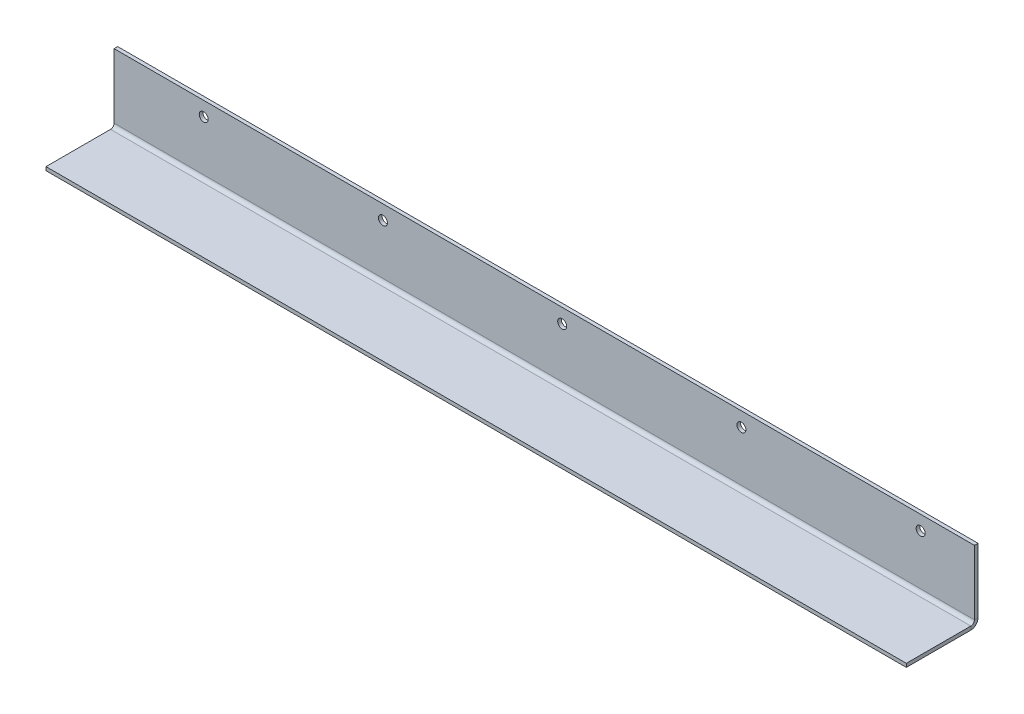
ISO-10303-21;
HEADER;
FILE_DESCRIPTION(('STEP AP214'),'2;1');
FILE_NAME('part.step','',(''),(''),'','','');
FILE_SCHEMA(('AUTOMOTIVE_DESIGN { 1 0 10303 214 1 1 1 1 }'));
ENDSEC;
DATA;
#1=APPLICATION_CONTEXT('core data for automotive mechanical design processes');
#2=APPLICATION_PROTOCOL_DEFINITION('international standard','automotive_design',2000,#1);
#3=PRODUCT_CONTEXT('',#1,'mechanical');
#4=PRODUCT('Part','Part','',(#3));
#5=PRODUCT_RELATED_PRODUCT_CATEGORY('part','',(#4));
#6=PRODUCT_DEFINITION_FORMATION('','',#4);
#7=PRODUCT_DEFINITION_CONTEXT('part definition',#1,'design');
#8=PRODUCT_DEFINITION('design','',#6,#7);
#9=PRODUCT_DEFINITION_SHAPE('','',#8);
#10=(LENGTH_UNIT() NAMED_UNIT(*) SI_UNIT(.MILLI.,.METRE.));
#11=(NAMED_UNIT(*) PLANE_ANGLE_UNIT() SI_UNIT($,.RADIAN.));
#12=(NAMED_UNIT(*) SI_UNIT($,.STERADIAN.) SOLID_ANGLE_UNIT());
#13=UNCERTAINTY_MEASURE_WITH_UNIT(LENGTH_MEASURE(1.E-05),#10,'distance_accuracy_value','');
#14=(GEOMETRIC_REPRESENTATION_CONTEXT(3) GLOBAL_UNCERTAINTY_ASSIGNED_CONTEXT((#13)) GLOBAL_UNIT_ASSIGNED_CONTEXT((#10,
#11,#12)) REPRESENTATION_CONTEXT('',''));
#15=CARTESIAN_POINT('',(0.,0.,0.));
#16=DIRECTION('',(0.,0.,1.));
#17=DIRECTION('',(1.,0.,0.));
#18=AXIS2_PLACEMENT_3D('',#15,#16,#17);
#19=CARTESIAN_POINT('',(0.,-2.,0.));
#20=DIRECTION('',(-1.,0.,0.));
#21=DIRECTION('',(0.,0.,1.));
#22=AXIS2_PLACEMENT_3D('',#19,#20,#21);
#23=PLANE('',#22);
#24=DIRECTION('',(0.,0.,1.));
#25=VECTOR('',#24,1.);
#26=CARTESIAN_POINT('',(0.,0.,0.));
#27=LINE('',#26,#25);
#28=CARTESIAN_POINT('',(0.,0.,-36.));
#29=VERTEX_POINT('',#28);
#30=CARTESIAN_POINT('',(0.,0.,0.));
#31=VERTEX_POINT('',#30);
#32=EDGE_CURVE('E112',#29,#31,#27,.T.);
#33=ORIENTED_EDGE('',*,*,#32,.F.);
#34=DIRECTION('',(0.,-1.,0.));
#35=VECTOR('',#34,1.);
#36=CARTESIAN_POINT('',(0.,0.,-36.));
#37=LINE('',#36,#35);
#38=CARTESIAN_POINT('',(0.,-2.00000000000001,-36.));
#39=VERTEX_POINT('',#38);
#40=EDGE_CURVE('E156',#29,#39,#37,.T.);
#41=ORIENTED_EDGE('',*,*,#40,.T.);
#42=DIRECTION('',(0.,0.,1.));
#43=VECTOR('',#42,1.);
#44=CARTESIAN_POINT('',(0.,-2.,0.));
#45=LINE('',#44,#43);
#46=CARTESIAN_POINT('',(0.,-2.,0.));
#47=VERTEX_POINT('',#46);
#48=EDGE_CURVE('E108',#39,#47,#45,.T.);
#49=ORIENTED_EDGE('',*,*,#48,.T.);
#50=DIRECTION('',(0.,1.,0.));
#51=VECTOR('',#50,1.);
#52=CARTESIAN_POINT('',(0.,-2.,0.));
#53=LINE('',#52,#51);
#54=EDGE_CURVE('E66',#47,#31,#53,.T.);
#55=ORIENTED_EDGE('',*,*,#54,.T.);
#56=EDGE_LOOP('',(#33,#41,#49,#55));
#57=FACE_BOUND('',#56,.T.);
#58=ADVANCED_FACE('F58',(#57),#23,.T.);
#59=CARTESIAN_POINT('',(0.,-2.,0.));
#60=DIRECTION('',(0.,-1.,0.));
#61=DIRECTION('',(0.,0.,-1.));
#62=AXIS2_PLACEMENT_3D('',#59,#60,#61);
#63=PLANE('',#62);
#64=ORIENTED_EDGE('',*,*,#48,.F.);
#65=DIRECTION('',(-1.,0.,0.));
#66=VECTOR('',#65,1.);
#67=CARTESIAN_POINT('',(0.,-2.00000000000001,-36.));
#68=LINE('',#67,#66);
#69=CARTESIAN_POINT('',(480.,-2.,-36.));
#70=VERTEX_POINT('',#69);
#71=EDGE_CURVE('E151',#39,#70,#68,.F.);
#72=ORIENTED_EDGE('',*,*,#71,.T.);
#73=DIRECTION('',(0.,0.,-1.));
#74=VECTOR('',#73,1.);
#75=CARTESIAN_POINT('',(480.,-2.,0.));
#76=LINE('',#75,#74);
#77=CARTESIAN_POINT('',(480.,-2.,0.));
#78=VERTEX_POINT('',#77);
#79=EDGE_CURVE('E119',#78,#70,#76,.T.);
#80=ORIENTED_EDGE('',*,*,#79,.F.);
#81=DIRECTION('',(1.,0.,0.));
#82=VECTOR('',#81,1.);
#83=CARTESIAN_POINT('',(0.,-2.,0.));
#84=LINE('',#83,#82);
#85=EDGE_CURVE('E99',#47,#78,#84,.T.);
#86=ORIENTED_EDGE('',*,*,#85,.F.);
#87=EDGE_LOOP('',(#64,#72,#80,#86));
#88=FACE_BOUND('',#87,.T.);
#89=ADVANCED_FACE('F175',(#88),#63,.T.);
#90=CARTESIAN_POINT('',(0.,0.,0.));
#91=DIRECTION('',(0.,-1.,0.));
#92=DIRECTION('',(0.,0.,-1.));
#93=AXIS2_PLACEMENT_3D('',#90,#91,#92);
#94=PLANE('',#93);
#95=DIRECTION('',(-1.,0.,0.));
#96=VECTOR('',#95,1.);
#97=CARTESIAN_POINT('',(0.,0.,-36.));
#98=LINE('',#97,#96);
#99=CARTESIAN_POINT('',(480.,0.,-36.));
#100=VERTEX_POINT('',#99);
#101=EDGE_CURVE('E162',#29,#100,#98,.F.);
#102=ORIENTED_EDGE('',*,*,#101,.F.);
#103=ORIENTED_EDGE('',*,*,#32,.T.);
#104=DIRECTION('',(1.,0.,0.));
#105=VECTOR('',#104,1.);
#106=CARTESIAN_POINT('',(0.,0.,0.));
#107=LINE('',#106,#105);
#108=CARTESIAN_POINT('',(480.,0.,0.));
#109=VERTEX_POINT('',#108);
#110=EDGE_CURVE('E97',#31,#109,#107,.T.);
#111=ORIENTED_EDGE('',*,*,#110,.T.);
#112=DIRECTION('',(0.,0.,-1.));
#113=VECTOR('',#112,1.);
#114=CARTESIAN_POINT('',(480.,0.,0.));
#115=LINE('',#114,#113);
#116=EDGE_CURVE('E102',#109,#100,#115,.T.);
#117=ORIENTED_EDGE('',*,*,#116,.T.);
#118=EDGE_LOOP('',(#102,#103,#111,#117));
#119=FACE_BOUND('',#118,.T.);
#120=ADVANCED_FACE('F110',(#119),#94,.F.);
#121=CARTESIAN_POINT('',(480.,-2.,0.));
#122=DIRECTION('',(1.,0.,0.));
#123=DIRECTION('',(0.,0.,-1.));
#124=AXIS2_PLACEMENT_3D('',#121,#122,#123);
#125=PLANE('',#124);
#126=DIRECTION('',(0.,-1.,0.));
#127=VECTOR('',#126,1.);
#128=CARTESIAN_POINT('',(480.,0.,-36.));
#129=LINE('',#128,#127);
#130=EDGE_CURVE('E105',#100,#70,#129,.T.);
#131=ORIENTED_EDGE('',*,*,#130,.F.);
#132=ORIENTED_EDGE('',*,*,#116,.F.);
#133=DIRECTION('',(0.,1.,0.));
#134=VECTOR('',#133,1.);
#135=CARTESIAN_POINT('',(480.,-2.,0.));
#136=LINE('',#135,#134);
#137=EDGE_CURVE('E13',#78,#109,#136,.T.);
#138=ORIENTED_EDGE('',*,*,#137,.F.);
#139=ORIENTED_EDGE('',*,*,#79,.T.);
#140=EDGE_LOOP('',(#131,#132,#138,#139));
#141=FACE_BOUND('',#140,.T.);
#142=ADVANCED_FACE('F103',(#141),#125,.T.);
#143=CARTESIAN_POINT('',(0.,-2.,0.));
#144=DIRECTION('',(0.,0.,1.));
#145=DIRECTION('',(1.,0.,0.));
#146=AXIS2_PLACEMENT_3D('',#143,#144,#145);
#147=PLANE('',#146);
#148=ORIENTED_EDGE('',*,*,#110,.F.);
#149=ORIENTED_EDGE('',*,*,#54,.F.);
#150=ORIENTED_EDGE('',*,*,#85,.T.);
#151=ORIENTED_EDGE('',*,*,#137,.T.);
#152=EDGE_LOOP('',(#148,#149,#150,#151));
#153=FACE_BOUND('',#152,.T.);
#154=ADVANCED_FACE('F94',(#153),#147,.T.);
#155=CARTESIAN_POINT('',(480.,1.99999999999999,-36.));
#156=DIRECTION('',(1.,0.,0.));
#157=DIRECTION('',(0.,0.,-1.));
#158=AXIS2_PLACEMENT_3D('',#155,#156,#157);
#159=PLANE('',#158);
#160=DIRECTION('',(0.,0.,1.));
#161=VECTOR('',#160,1.);
#162=CARTESIAN_POINT('',(480.,2.00000000000001,-40.));
#163=LINE('',#162,#161);
#164=CARTESIAN_POINT('',(480.,1.99999999999998,-38.));
#165=VERTEX_POINT('',#164);
#166=CARTESIAN_POINT('',(480.,1.99999999999997,-40.));
#167=VERTEX_POINT('',#166);
#168=EDGE_CURVE('E134',#165,#167,#163,.F.);
#169=ORIENTED_EDGE('',*,*,#168,.F.);
#170=CARTESIAN_POINT('',(480.,1.99999999999999,-36.));
#171=DIRECTION('',(-1.,0.,0.));
#172=DIRECTION('',(0.,0.,1.));
#173=AXIS2_PLACEMENT_3D('',#170,#171,#172);
#174=CIRCLE('',#173,2.);
#175=EDGE_CURVE('E159',#100,#165,#174,.F.);
#176=ORIENTED_EDGE('',*,*,#175,.F.);
#177=ORIENTED_EDGE('',*,*,#130,.T.);
#178=CARTESIAN_POINT('',(480.,1.99999999999999,-36.));
#179=DIRECTION('',(-1.,0.,0.));
#180=DIRECTION('',(0.,0.,1.));
#181=AXIS2_PLACEMENT_3D('',#178,#179,#180);
#182=CIRCLE('',#181,4.);
#183=EDGE_CURVE('E74',#70,#167,#182,.F.);
#184=ORIENTED_EDGE('',*,*,#183,.T.);
#185=EDGE_LOOP('',(#169,#176,#177,#184));
#186=FACE_BOUND('',#185,.T.);
#187=ADVANCED_FACE('F218',(#186),#159,.T.);
#188=CARTESIAN_POINT('',(0.,1.99999999999999,-36.));
#189=DIRECTION('',(1.,0.,0.));
#190=DIRECTION('',(0.,0.,-1.));
#191=AXIS2_PLACEMENT_3D('',#188,#189,#190);
#192=PLANE('',#191);
#193=CARTESIAN_POINT('',(0.,1.99999999999999,-36.));
#194=DIRECTION('',(-1.,0.,0.));
#195=DIRECTION('',(0.,0.,1.));
#196=AXIS2_PLACEMENT_3D('',#193,#194,#195);
#197=CIRCLE('',#196,2.);
#198=CARTESIAN_POINT('',(0.,1.99999999999998,-38.));
#199=VERTEX_POINT('',#198);
#200=EDGE_CURVE('E165',#199,#29,#197,.T.);
#201=ORIENTED_EDGE('',*,*,#200,.F.);
#202=DIRECTION('',(0.,0.,1.));
#203=VECTOR('',#202,1.);
#204=CARTESIAN_POINT('',(0.,2.00000000000001,-38.));
#205=LINE('',#204,#203);
#206=CARTESIAN_POINT('',(0.,2.00000000000002,-40.));
#207=VERTEX_POINT('',#206);
#208=EDGE_CURVE('E147',#199,#207,#205,.F.);
#209=ORIENTED_EDGE('',*,*,#208,.T.);
#210=CARTESIAN_POINT('',(0.,1.99999999999999,-36.));
#211=DIRECTION('',(-1.,0.,0.));
#212=DIRECTION('',(0.,0.,1.));
#213=AXIS2_PLACEMENT_3D('',#210,#211,#212);
#214=CIRCLE('',#213,4.);
#215=EDGE_CURVE('E154',#207,#39,#214,.T.);
#216=ORIENTED_EDGE('',*,*,#215,.T.);
#217=ORIENTED_EDGE('',*,*,#40,.F.);
#218=EDGE_LOOP('',(#201,#209,#216,#217));
#219=FACE_BOUND('',#218,.T.);
#220=ADVANCED_FACE('F184',(#219),#192,.F.);
#221=CARTESIAN_POINT('',(0.,1.99999999999999,-36.));
#222=DIRECTION('',(-1.,0.,0.));
#223=DIRECTION('',(0.,0.,-1.));
#224=AXIS2_PLACEMENT_3D('',#221,#222,#223);
#225=CYLINDRICAL_SURFACE('',#224,4.);
#226=ORIENTED_EDGE('',*,*,#71,.F.);
#227=ORIENTED_EDGE('',*,*,#215,.F.);
#228=DIRECTION('',(-1.,0.,0.));
#229=VECTOR('',#228,1.);
#230=CARTESIAN_POINT('',(480.,2.00000000000001,-40.));
#231=LINE('',#230,#229);
#232=EDGE_CURVE('E214',#207,#167,#231,.F.);
#233=ORIENTED_EDGE('',*,*,#232,.T.);
#234=ORIENTED_EDGE('',*,*,#183,.F.);
#235=EDGE_LOOP('',(#226,#227,#233,#234));
#236=FACE_BOUND('',#235,.T.);
#237=ADVANCED_FACE('F177',(#236),#225,.T.);
#238=CARTESIAN_POINT('',(0.,1.99999999999999,-36.));
#239=DIRECTION('',(-1.,0.,0.));
#240=DIRECTION('',(0.,0.,-1.));
#241=AXIS2_PLACEMENT_3D('',#238,#239,#240);
#242=CYLINDRICAL_SURFACE('',#241,2.);
#243=ORIENTED_EDGE('',*,*,#101,.T.);
#244=ORIENTED_EDGE('',*,*,#175,.T.);
#245=DIRECTION('',(-1.,0.,0.));
#246=VECTOR('',#245,1.);
#247=CARTESIAN_POINT('',(480.,1.99999999999999,-38.));
#248=LINE('',#247,#246);
#249=EDGE_CURVE('E138',#165,#199,#248,.T.);
#250=ORIENTED_EDGE('',*,*,#249,.T.);
#251=ORIENTED_EDGE('',*,*,#200,.T.);
#252=EDGE_LOOP('',(#243,#244,#250,#251));
#253=FACE_BOUND('',#252,.T.);
#254=ADVANCED_FACE('F221',(#253),#242,.F.);
#255=CARTESIAN_POINT('',(480.,0.,-40.));
#256=DIRECTION('',(-1.,0.,0.));
#257=DIRECTION('',(0.,0.,1.));
#258=AXIS2_PLACEMENT_3D('',#255,#256,#257);
#259=PLANE('',#258);
#260=ORIENTED_EDGE('',*,*,#168,.T.);
#261=DIRECTION('',(0.,-1.,0.));
#262=VECTOR('',#261,1.);
#263=CARTESIAN_POINT('',(480.,-1.45760840755831E-13,-40.));
#264=LINE('',#263,#262);
#265=CARTESIAN_POINT('',(480.,38.,-40.0000000000001));
#266=VERTEX_POINT('',#265);
#267=EDGE_CURVE('E236',#266,#167,#264,.T.);
#268=ORIENTED_EDGE('',*,*,#267,.F.);
#269=DIRECTION('',(0.,0.,1.));
#270=VECTOR('',#269,1.);
#271=CARTESIAN_POINT('',(480.,38.,-40.0000000000001));
#272=LINE('',#271,#270);
#273=CARTESIAN_POINT('',(480.,38.,-38.0000000000001));
#274=VERTEX_POINT('',#273);
#275=EDGE_CURVE('E230',#266,#274,#272,.T.);
#276=ORIENTED_EDGE('',*,*,#275,.T.);
#277=DIRECTION('',(0.,1.,0.));
#278=VECTOR('',#277,1.);
#279=CARTESIAN_POINT('',(480.,0.,-38.));
#280=LINE('',#279,#278);
#281=EDGE_CURVE('E216',#274,#165,#280,.F.);
#282=ORIENTED_EDGE('',*,*,#281,.T.);
#283=EDGE_LOOP('',(#260,#268,#276,#282));
#284=FACE_BOUND('',#283,.T.);
#285=ADVANCED_FACE('F229',(#284),#259,.F.);
#286=CARTESIAN_POINT('',(0.,38.,-40.0000000000001));
#287=DIRECTION('',(1.,0.,0.));
#288=DIRECTION('',(0.,0.,-1.));
#289=AXIS2_PLACEMENT_3D('',#286,#287,#288);
#290=PLANE('',#289);
#291=ORIENTED_EDGE('',*,*,#208,.F.);
#292=DIRECTION('',(0.,-1.,0.));
#293=VECTOR('',#292,1.);
#294=CARTESIAN_POINT('',(0.,38.,-38.0000000000001));
#295=LINE('',#294,#293);
#296=CARTESIAN_POINT('',(0.,38.,-38.0000000000001));
#297=VERTEX_POINT('',#296);
#298=EDGE_CURVE('E227',#199,#297,#295,.F.);
#299=ORIENTED_EDGE('',*,*,#298,.T.);
#300=DIRECTION('',(0.,0.,1.));
#301=VECTOR('',#300,1.);
#302=CARTESIAN_POINT('',(0.,38.,-40.0000000000001));
#303=LINE('',#302,#301);
#304=CARTESIAN_POINT('',(0.,38.,-40.0000000000001));
#305=VERTEX_POINT('',#304);
#306=EDGE_CURVE('E168',#305,#297,#303,.T.);
#307=ORIENTED_EDGE('',*,*,#306,.F.);
#308=DIRECTION('',(0.,1.,0.));
#309=VECTOR('',#308,1.);
#310=CARTESIAN_POINT('',(0.,-1.45760840755831E-13,-40.));
#311=LINE('',#310,#309);
#312=EDGE_CURVE('E238',#207,#305,#311,.T.);
#313=ORIENTED_EDGE('',*,*,#312,.F.);
#314=EDGE_LOOP('',(#291,#299,#307,#313));
#315=FACE_BOUND('',#314,.T.);
#316=ADVANCED_FACE('F264',(#315),#290,.F.);
#317=CARTESIAN_POINT('',(0.,-1.45760840755831E-13,-40.));
#318=DIRECTION('',(0.,0.,1.));
#319=DIRECTION('',(0.,-1.,0.));
#320=AXIS2_PLACEMENT_3D('',#317,#318,#319);
#321=PLANE('',#320);
#322=CARTESIAN_POINT('',(450.,29.9999999999999,-40.0000000000001));
#323=DIRECTION('',(0.,0.,-1.));
#324=DIRECTION('',(0.,1.,0.));
#325=AXIS2_PLACEMENT_3D('',#322,#323,#324);
#326=CIRCLE('',#325,2.50000000000002);
#327=CARTESIAN_POINT('',(450.,32.4999999999999,-40.0000000000001));
#328=VERTEX_POINT('',#327);
#329=EDGE_CURVE('E124',#328,#328,#326,.T.);
#330=ORIENTED_EDGE('',*,*,#329,.F.);
#331=EDGE_LOOP('',(#330));
#332=FACE_BOUND('',#331,.T.);
#333=CARTESIAN_POINT('',(350.,29.9999999999999,-40.0000000000001));
#334=DIRECTION('',(0.,0.,-1.));
#335=DIRECTION('',(0.,1.,0.));
#336=AXIS2_PLACEMENT_3D('',#333,#334,#335);
#337=CIRCLE('',#336,2.50000000000002);
#338=CARTESIAN_POINT('',(350.,32.4999999999999,-40.0000000000001));
#339=VERTEX_POINT('',#338);
#340=EDGE_CURVE('E253',#339,#339,#337,.T.);
#341=ORIENTED_EDGE('',*,*,#340,.F.);
#342=EDGE_LOOP('',(#341));
#343=FACE_BOUND('',#342,.T.);
#344=CARTESIAN_POINT('',(250.,29.9999999999999,-40.0000000000001));
#345=DIRECTION('',(0.,0.,-1.));
#346=DIRECTION('',(0.,1.,0.));
#347=AXIS2_PLACEMENT_3D('',#344,#345,#346);
#348=CIRCLE('',#347,2.50000000000002);
#349=CARTESIAN_POINT('',(250.,32.4999999999999,-40.0000000000001));
#350=VERTEX_POINT('',#349);
#351=EDGE_CURVE('E250',#350,#350,#348,.T.);
#352=ORIENTED_EDGE('',*,*,#351,.F.);
#353=EDGE_LOOP('',(#352));
#354=FACE_BOUND('',#353,.T.);
#355=CARTESIAN_POINT('',(150.,29.9999999999999,-40.0000000000001));
#356=DIRECTION('',(0.,0.,-1.));
#357=DIRECTION('',(0.,1.,0.));
#358=AXIS2_PLACEMENT_3D('',#355,#356,#357);
#359=CIRCLE('',#358,2.50000000000002);
#360=CARTESIAN_POINT('',(150.,32.4999999999999,-40.0000000000001));
#361=VERTEX_POINT('',#360);
#362=EDGE_CURVE('E247',#361,#361,#359,.T.);
#363=ORIENTED_EDGE('',*,*,#362,.F.);
#364=EDGE_LOOP('',(#363));
#365=FACE_BOUND('',#364,.T.);
#366=CARTESIAN_POINT('',(50.,29.9999999999999,-40.0000000000001));
#367=DIRECTION('',(0.,0.,-1.));
#368=DIRECTION('',(0.,1.,0.));
#369=AXIS2_PLACEMENT_3D('',#366,#367,#368);
#370=CIRCLE('',#369,2.50000000000002);
#371=CARTESIAN_POINT('',(50.,32.4999999999999,-40.0000000000001));
#372=VERTEX_POINT('',#371);
#373=EDGE_CURVE('E244',#372,#372,#370,.T.);
#374=ORIENTED_EDGE('',*,*,#373,.F.);
#375=EDGE_LOOP('',(#374));
#376=FACE_BOUND('',#375,.T.);
#377=ORIENTED_EDGE('',*,*,#232,.F.);
#378=ORIENTED_EDGE('',*,*,#312,.T.);
#379=DIRECTION('',(1.,0.,0.));
#380=VECTOR('',#379,1.);
#381=CARTESIAN_POINT('',(0.,38.,-40.0000000000001));
#382=LINE('',#381,#380);
#383=EDGE_CURVE('E203',#305,#266,#382,.T.);
#384=ORIENTED_EDGE('',*,*,#383,.T.);
#385=ORIENTED_EDGE('',*,*,#267,.T.);
#386=EDGE_LOOP('',(#377,#378,#384,#385));
#387=FACE_BOUND('',#386,.T.);
#388=ADVANCED_FACE('F261',(#332,#343,#354,#365,#376,#387),#321,.F.);
#389=CARTESIAN_POINT('',(0.,-1.38777878078145E-13,-38.));
#390=DIRECTION('',(0.,0.,1.));
#391=DIRECTION('',(0.,-1.,0.));
#392=AXIS2_PLACEMENT_3D('',#389,#390,#391);
#393=PLANE('',#392);
#394=CARTESIAN_POINT('',(450.,29.9999999999999,-38.0000000000001));
#395=DIRECTION('',(0.,0.,1.));
#396=DIRECTION('',(0.,-1.,0.));
#397=AXIS2_PLACEMENT_3D('',#394,#395,#396);
#398=CIRCLE('',#397,2.50000000000002);
#399=CARTESIAN_POINT('',(450.,27.4999999999998,-38.0000000000001));
#400=VERTEX_POINT('',#399);
#401=EDGE_CURVE('E61',#400,#400,#398,.T.);
#402=ORIENTED_EDGE('',*,*,#401,.F.);
#403=EDGE_LOOP('',(#402));
#404=FACE_BOUND('',#403,.T.);
#405=CARTESIAN_POINT('',(350.,29.9999999999999,-38.0000000000001));
#406=DIRECTION('',(0.,0.,1.));
#407=DIRECTION('',(0.,-1.,0.));
#408=AXIS2_PLACEMENT_3D('',#405,#406,#407);
#409=CIRCLE('',#408,2.50000000000002);
#410=CARTESIAN_POINT('',(350.,27.4999999999998,-38.0000000000001));
#411=VERTEX_POINT('',#410);
#412=EDGE_CURVE('E129',#411,#411,#409,.T.);
#413=ORIENTED_EDGE('',*,*,#412,.F.);
#414=EDGE_LOOP('',(#413));
#415=FACE_BOUND('',#414,.T.);
#416=CARTESIAN_POINT('',(250.,29.9999999999999,-38.0000000000001));
#417=DIRECTION('',(0.,0.,1.));
#418=DIRECTION('',(0.,-1.,0.));
#419=AXIS2_PLACEMENT_3D('',#416,#417,#418);
#420=CIRCLE('',#419,2.50000000000002);
#421=CARTESIAN_POINT('',(250.,27.4999999999998,-38.0000000000001));
#422=VERTEX_POINT('',#421);
#423=EDGE_CURVE('E127',#422,#422,#420,.T.);
#424=ORIENTED_EDGE('',*,*,#423,.F.);
#425=EDGE_LOOP('',(#424));
#426=FACE_BOUND('',#425,.T.);
#427=CARTESIAN_POINT('',(150.,29.9999999999999,-38.0000000000001));
#428=DIRECTION('',(0.,0.,1.));
#429=DIRECTION('',(0.,-1.,0.));
#430=AXIS2_PLACEMENT_3D('',#427,#428,#429);
#431=CIRCLE('',#430,2.50000000000002);
#432=CARTESIAN_POINT('',(150.,27.4999999999998,-38.0000000000001));
#433=VERTEX_POINT('',#432);
#434=EDGE_CURVE('E123',#433,#433,#431,.T.);
#435=ORIENTED_EDGE('',*,*,#434,.F.);
#436=EDGE_LOOP('',(#435));
#437=FACE_BOUND('',#436,.T.);
#438=CARTESIAN_POINT('',(50.,29.9999999999999,-38.0000000000001));
#439=DIRECTION('',(0.,0.,1.));
#440=DIRECTION('',(0.,-1.,0.));
#441=AXIS2_PLACEMENT_3D('',#438,#439,#440);
#442=CIRCLE('',#441,2.50000000000002);
#443=CARTESIAN_POINT('',(50.,27.4999999999998,-38.0000000000001));
#444=VERTEX_POINT('',#443);
#445=EDGE_CURVE('E120',#444,#444,#442,.T.);
#446=ORIENTED_EDGE('',*,*,#445,.F.);
#447=EDGE_LOOP('',(#446));
#448=FACE_BOUND('',#447,.T.);
#449=ORIENTED_EDGE('',*,*,#298,.F.);
#450=ORIENTED_EDGE('',*,*,#249,.F.);
#451=ORIENTED_EDGE('',*,*,#281,.F.);
#452=DIRECTION('',(-1.,0.,0.));
#453=VECTOR('',#452,1.);
#454=CARTESIAN_POINT('',(480.,38.,-38.0000000000001));
#455=LINE('',#454,#453);
#456=EDGE_CURVE('E232',#297,#274,#455,.F.);
#457=ORIENTED_EDGE('',*,*,#456,.F.);
#458=EDGE_LOOP('',(#449,#450,#451,#457));
#459=FACE_BOUND('',#458,.T.);
#460=ADVANCED_FACE('F225',(#404,#415,#426,#437,#448,#459),#393,.T.);
#461=CARTESIAN_POINT('',(480.,38.,-40.0000000000001));
#462=DIRECTION('',(0.,-1.,0.));
#463=DIRECTION('',(0.,0.,-1.));
#464=AXIS2_PLACEMENT_3D('',#461,#462,#463);
#465=PLANE('',#464);
#466=ORIENTED_EDGE('',*,*,#456,.T.);
#467=ORIENTED_EDGE('',*,*,#275,.F.);
#468=ORIENTED_EDGE('',*,*,#383,.F.);
#469=ORIENTED_EDGE('',*,*,#306,.T.);
#470=EDGE_LOOP('',(#466,#467,#468,#469));
#471=FACE_BOUND('',#470,.T.);
#472=ADVANCED_FACE('F277',(#471),#465,.F.);
#473=CARTESIAN_POINT('',(50.,30.,0.));
#474=DIRECTION('',(0.,0.,-1.));
#475=DIRECTION('',(0.,1.,0.));
#476=AXIS2_PLACEMENT_3D('',#473,#474,#475);
#477=CYLINDRICAL_SURFACE('',#476,2.50000000000002);
#478=ORIENTED_EDGE('',*,*,#445,.T.);
#479=EDGE_LOOP('',(#478));
#480=FACE_BOUND('',#479,.T.);
#481=ORIENTED_EDGE('',*,*,#373,.T.);
#482=EDGE_LOOP('',(#481));
#483=FACE_BOUND('',#482,.T.);
#484=ADVANCED_FACE('F274',(#480,#483),#477,.F.);
#485=CARTESIAN_POINT('',(150.,30.,0.));
#486=DIRECTION('',(0.,0.,-1.));
#487=DIRECTION('',(0.,1.,0.));
#488=AXIS2_PLACEMENT_3D('',#485,#486,#487);
#489=CYLINDRICAL_SURFACE('',#488,2.50000000000002);
#490=ORIENTED_EDGE('',*,*,#434,.T.);
#491=EDGE_LOOP('',(#490));
#492=FACE_BOUND('',#491,.T.);
#493=ORIENTED_EDGE('',*,*,#362,.T.);
#494=EDGE_LOOP('',(#493));
#495=FACE_BOUND('',#494,.T.);
#496=ADVANCED_FACE('F276',(#492,#495),#489,.F.);
#497=CARTESIAN_POINT('',(250.,30.,0.));
#498=DIRECTION('',(0.,0.,-1.));
#499=DIRECTION('',(0.,1.,0.));
#500=AXIS2_PLACEMENT_3D('',#497,#498,#499);
#501=CYLINDRICAL_SURFACE('',#500,2.50000000000002);
#502=ORIENTED_EDGE('',*,*,#423,.T.);
#503=EDGE_LOOP('',(#502));
#504=FACE_BOUND('',#503,.T.);
#505=ORIENTED_EDGE('',*,*,#351,.T.);
#506=EDGE_LOOP('',(#505));
#507=FACE_BOUND('',#506,.T.);
#508=ADVANCED_FACE('F284',(#504,#507),#501,.F.);
#509=CARTESIAN_POINT('',(350.,30.,0.));
#510=DIRECTION('',(0.,0.,-1.));
#511=DIRECTION('',(0.,1.,0.));
#512=AXIS2_PLACEMENT_3D('',#509,#510,#511);
#513=CYLINDRICAL_SURFACE('',#512,2.50000000000002);
#514=ORIENTED_EDGE('',*,*,#412,.T.);
#515=EDGE_LOOP('',(#514));
#516=FACE_BOUND('',#515,.T.);
#517=ORIENTED_EDGE('',*,*,#340,.T.);
#518=EDGE_LOOP('',(#517));
#519=FACE_BOUND('',#518,.T.);
#520=ADVANCED_FACE('F334',(#516,#519),#513,.F.);
#521=CARTESIAN_POINT('',(450.,30.,0.));
#522=DIRECTION('',(0.,0.,-1.));
#523=DIRECTION('',(0.,1.,0.));
#524=AXIS2_PLACEMENT_3D('',#521,#522,#523);
#525=CYLINDRICAL_SURFACE('',#524,2.50000000000002);
#526=ORIENTED_EDGE('',*,*,#401,.T.);
#527=EDGE_LOOP('',(#526));
#528=FACE_BOUND('',#527,.T.);
#529=ORIENTED_EDGE('',*,*,#329,.T.);
#530=EDGE_LOOP('',(#529));
#531=FACE_BOUND('',#530,.T.);
#532=ADVANCED_FACE('F259',(#528,#531),#525,.F.);
#533=CLOSED_SHELL('',(#58,#89,#120,#142,#154,#187,#220,#237,#254,#285,#316,#388,#460,#472,#484,
#496,#508,#520,#532));
#534=MANIFOLD_SOLID_BREP('B2',#533);
#535=ADVANCED_BREP_SHAPE_REPRESENTATION('',(#18,#534),#14);
#536=SHAPE_DEFINITION_REPRESENTATION(#9,#535);
ENDSEC;
END-ISO-10303-21;
